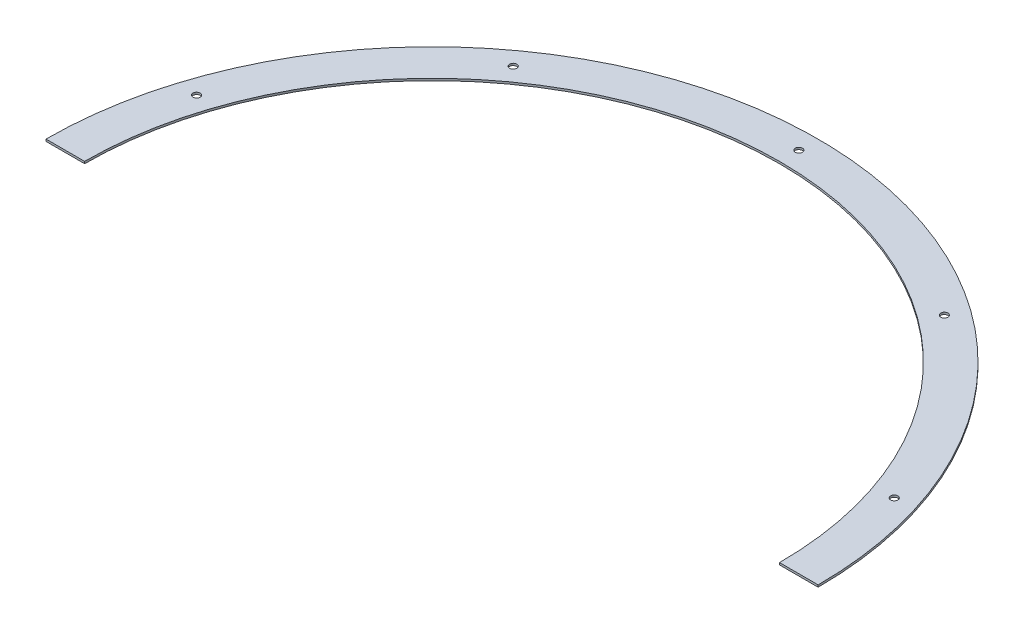
ISO-10303-21;
HEADER;
FILE_DESCRIPTION(('STEP AP214'),'2;1');
FILE_NAME('part.step','',(''),(''),'','','');
FILE_SCHEMA(('AUTOMOTIVE_DESIGN { 1 0 10303 214 1 1 1 1 }'));
ENDSEC;
DATA;
#1=APPLICATION_CONTEXT('core data for automotive mechanical design processes');
#2=APPLICATION_PROTOCOL_DEFINITION('international standard','automotive_design',2000,#1);
#3=PRODUCT_CONTEXT('',#1,'mechanical');
#4=PRODUCT('Part','Part','',(#3));
#5=PRODUCT_RELATED_PRODUCT_CATEGORY('part','',(#4));
#6=PRODUCT_DEFINITION_FORMATION('','',#4);
#7=PRODUCT_DEFINITION_CONTEXT('part definition',#1,'design');
#8=PRODUCT_DEFINITION('design','',#6,#7);
#9=PRODUCT_DEFINITION_SHAPE('','',#8);
#10=(LENGTH_UNIT() NAMED_UNIT(*) SI_UNIT(.MILLI.,.METRE.));
#11=(NAMED_UNIT(*) PLANE_ANGLE_UNIT() SI_UNIT($,.RADIAN.));
#12=(NAMED_UNIT(*) SI_UNIT($,.STERADIAN.) SOLID_ANGLE_UNIT());
#13=UNCERTAINTY_MEASURE_WITH_UNIT(LENGTH_MEASURE(1.E-05),#10,'distance_accuracy_value','');
#14=(GEOMETRIC_REPRESENTATION_CONTEXT(3) GLOBAL_UNCERTAINTY_ASSIGNED_CONTEXT((#13)) GLOBAL_UNIT_ASSIGNED_CONTEXT((#10,
#11,#12)) REPRESENTATION_CONTEXT('',''));
#15=CARTESIAN_POINT('',(0.,0.,0.));
#16=DIRECTION('',(0.,0.,1.));
#17=DIRECTION('',(1.,0.,0.));
#18=AXIS2_PLACEMENT_3D('',#15,#16,#17);
#19=CARTESIAN_POINT('',(0.,0.,0.));
#20=DIRECTION('',(0.,0.,1.));
#21=DIRECTION('',(0.,1.,0.));
#22=AXIS2_PLACEMENT_3D('',#19,#20,#21);
#23=PLANE('',#22);
#24=DIRECTION('',(1.,0.,0.));
#25=VECTOR('',#24,1.);
#26=CARTESIAN_POINT('',(0.,2.032,0.));
#27=LINE('',#26,#25);
#28=CARTESIAN_POINT('',(-381.,2.032,0.));
#29=VERTEX_POINT('',#28);
#30=CARTESIAN_POINT('',(-342.9,2.032,0.));
#31=VERTEX_POINT('',#30);
#32=EDGE_CURVE('E73',#29,#31,#27,.T.);
#33=ORIENTED_EDGE('',*,*,#32,.F.);
#34=DIRECTION('',(0.,-1.,0.));
#35=VECTOR('',#34,1.);
#36=CARTESIAN_POINT('',(-381.,2.032,0.));
#37=LINE('',#36,#35);
#38=CARTESIAN_POINT('',(-381.,0.,0.));
#39=VERTEX_POINT('',#38);
#40=EDGE_CURVE('E82',#29,#39,#37,.T.);
#41=ORIENTED_EDGE('',*,*,#40,.T.);
#42=DIRECTION('',(1.,0.,0.));
#43=VECTOR('',#42,1.);
#44=CARTESIAN_POINT('',(0.,0.,0.));
#45=LINE('',#44,#43);
#46=CARTESIAN_POINT('',(-342.9,0.,0.));
#47=VERTEX_POINT('',#46);
#48=EDGE_CURVE('E83',#39,#47,#45,.T.);
#49=ORIENTED_EDGE('',*,*,#48,.T.);
#50=DIRECTION('',(0.,-1.,0.));
#51=VECTOR('',#50,1.);
#52=CARTESIAN_POINT('',(-342.9,2.032,0.));
#53=LINE('',#52,#51);
#54=EDGE_CURVE('E43',#31,#47,#53,.T.);
#55=ORIENTED_EDGE('',*,*,#54,.F.);
#56=EDGE_LOOP('',(#33,#41,#49,#55));
#57=FACE_BOUND('',#56,.T.);
#58=ADVANCED_FACE('F26',(#57),#23,.T.);
#59=CARTESIAN_POINT('',(342.9,0.,0.));
#60=VERTEX_POINT('',#59);
#61=CARTESIAN_POINT('',(381.,0.,0.));
#62=VERTEX_POINT('',#61);
#63=EDGE_CURVE('E87',#60,#62,#45,.T.);
#64=ORIENTED_EDGE('',*,*,#63,.T.);
#65=DIRECTION('',(0.,-1.,0.));
#66=VECTOR('',#65,1.);
#67=CARTESIAN_POINT('',(381.,2.032,0.));
#68=LINE('',#67,#66);
#69=CARTESIAN_POINT('',(381.,2.032,0.));
#70=VERTEX_POINT('',#69);
#71=EDGE_CURVE('E88',#62,#70,#68,.F.);
#72=ORIENTED_EDGE('',*,*,#71,.T.);
#73=CARTESIAN_POINT('',(342.9,2.032,0.));
#74=VERTEX_POINT('',#73);
#75=EDGE_CURVE('E74',#74,#70,#27,.T.);
#76=ORIENTED_EDGE('',*,*,#75,.F.);
#77=DIRECTION('',(0.,-1.,0.));
#78=VECTOR('',#77,1.);
#79=CARTESIAN_POINT('',(342.9,2.032,0.));
#80=LINE('',#79,#78);
#81=EDGE_CURVE('E51',#60,#74,#80,.F.);
#82=ORIENTED_EDGE('',*,*,#81,.F.);
#83=EDGE_LOOP('',(#64,#72,#76,#82));
#84=FACE_BOUND('',#83,.T.);
#85=ADVANCED_FACE('F130',(#84),#23,.T.);
#86=CARTESIAN_POINT('',(212.748872067257,-0.00100000000000013,-292.823701114015));
#87=DIRECTION('',(0.,1.,0.));
#88=DIRECTION('',(-1.,0.,0.));
#89=AXIS2_PLACEMENT_3D('',#86,#87,#88);
#90=CYLINDRICAL_SURFACE('',#89,3.55599999999999);
#91=CARTESIAN_POINT('',(212.748872067257,2.032,-292.823701114015));
#92=DIRECTION('',(0.,1.,0.));
#93=DIRECTION('',(-0.809016994374955,0.,-0.587785252292462));
#94=AXIS2_PLACEMENT_3D('',#91,#92,#93);
#95=CIRCLE('',#94,3.55599999999999);
#96=CARTESIAN_POINT('',(209.872007635259,2.032,-294.913865471167));
#97=VERTEX_POINT('',#96);
#98=EDGE_CURVE('E11',#97,#97,#95,.T.);
#99=ORIENTED_EDGE('',*,*,#98,.T.);
#100=EDGE_LOOP('',(#99));
#101=FACE_BOUND('',#100,.T.);
#102=CARTESIAN_POINT('',(212.748872067257,0.,-292.823701114015));
#103=DIRECTION('',(0.,1.,0.));
#104=DIRECTION('',(-1.,0.,0.));
#105=AXIS2_PLACEMENT_3D('',#102,#103,#104);
#106=CIRCLE('',#105,3.55599999999999);
#107=CARTESIAN_POINT('',(209.192872067257,0.,-292.823701114015));
#108=VERTEX_POINT('',#107);
#109=EDGE_CURVE('E35',#108,#108,#106,.F.);
#110=ORIENTED_EDGE('',*,*,#109,.T.);
#111=EDGE_LOOP('',(#110));
#112=FACE_BOUND('',#111,.T.);
#113=ADVANCED_FACE('F132',(#101,#112),#90,.F.);
#114=CARTESIAN_POINT('',(344.23490607303,-0.00100000000000013,-111.848701114016));
#115=DIRECTION('',(0.,1.,0.));
#116=DIRECTION('',(-1.,0.,0.));
#117=AXIS2_PLACEMENT_3D('',#114,#115,#116);
#118=CYLINDRICAL_SURFACE('',#117,3.55599999999999);
#119=CARTESIAN_POINT('',(344.23490607303,2.032,-111.848701114016));
#120=DIRECTION('',(0.,1.,0.));
#121=DIRECTION('',(-0.309016994374958,0.,-0.95105651629515));
#122=AXIS2_PLACEMENT_3D('',#119,#120,#121);
#123=CIRCLE('',#122,3.55599999999999);
#124=CARTESIAN_POINT('',(343.136041641032,2.032,-115.230658085962));
#125=VERTEX_POINT('',#124);
#126=EDGE_CURVE('E122',#125,#125,#123,.T.);
#127=ORIENTED_EDGE('',*,*,#126,.T.);
#128=EDGE_LOOP('',(#127));
#129=FACE_BOUND('',#128,.T.);
#130=CARTESIAN_POINT('',(344.23490607303,0.,-111.848701114016));
#131=DIRECTION('',(0.,1.,0.));
#132=DIRECTION('',(-1.,0.,0.));
#133=AXIS2_PLACEMENT_3D('',#130,#131,#132);
#134=CIRCLE('',#133,3.55599999999999);
#135=CARTESIAN_POINT('',(340.67890607303,0.,-111.848701114016));
#136=VERTEX_POINT('',#135);
#137=EDGE_CURVE('E119',#136,#136,#134,.F.);
#138=ORIENTED_EDGE('',*,*,#137,.T.);
#139=EDGE_LOOP('',(#138));
#140=FACE_BOUND('',#139,.T.);
#141=ADVANCED_FACE('F138',(#129,#140),#118,.F.);
#142=CARTESIAN_POINT('',(-344.234906073031,-0.00100000000000013,-111.848701114011));
#143=DIRECTION('',(0.,1.,0.));
#144=DIRECTION('',(-1.,0.,0.));
#145=AXIS2_PLACEMENT_3D('',#142,#143,#144);
#146=CYLINDRICAL_SURFACE('',#145,3.55599999999999);
#147=CARTESIAN_POINT('',(-344.234906073031,2.032,-111.848701114011));
#148=DIRECTION('',(0.,1.,0.));
#149=DIRECTION('',(-0.309016994374945,0.,0.951056516295155));
#150=AXIS2_PLACEMENT_3D('',#147,#148,#149);
#151=CIRCLE('',#150,3.55599999999999);
#152=CARTESIAN_POINT('',(-345.333770505028,2.032,-108.466744142066));
#153=VERTEX_POINT('',#152);
#154=EDGE_CURVE('E116',#153,#153,#151,.T.);
#155=ORIENTED_EDGE('',*,*,#154,.T.);
#156=EDGE_LOOP('',(#155));
#157=FACE_BOUND('',#156,.T.);
#158=CARTESIAN_POINT('',(-344.234906073031,0.,-111.848701114011));
#159=DIRECTION('',(0.,1.,0.));
#160=DIRECTION('',(-1.,0.,0.));
#161=AXIS2_PLACEMENT_3D('',#158,#159,#160);
#162=CIRCLE('',#161,3.55599999999999);
#163=CARTESIAN_POINT('',(-347.790906073031,0.,-111.848701114011));
#164=VERTEX_POINT('',#163);
#165=EDGE_CURVE('E113',#164,#164,#162,.F.);
#166=ORIENTED_EDGE('',*,*,#165,.T.);
#167=EDGE_LOOP('',(#166));
#168=FACE_BOUND('',#167,.T.);
#169=ADVANCED_FACE('F177',(#157,#168),#146,.F.);
#170=CARTESIAN_POINT('',(-212.748872067261,-0.00100000000000013,-292.823701114012));
#171=DIRECTION('',(0.,1.,0.));
#172=DIRECTION('',(-1.,0.,0.));
#173=AXIS2_PLACEMENT_3D('',#170,#171,#172);
#174=CYLINDRICAL_SURFACE('',#173,3.55599999999999);
#175=CARTESIAN_POINT('',(-212.748872067261,2.032,-292.823701114012));
#176=DIRECTION('',(0.,1.,0.));
#177=DIRECTION('',(-0.809016994374947,0.,0.587785252292474));
#178=AXIS2_PLACEMENT_3D('',#175,#176,#177);
#179=CIRCLE('',#178,3.55599999999999);
#180=CARTESIAN_POINT('',(-215.625736499258,2.032,-290.73353675686));
#181=VERTEX_POINT('',#180);
#182=EDGE_CURVE('E110',#181,#181,#179,.T.);
#183=ORIENTED_EDGE('',*,*,#182,.T.);
#184=EDGE_LOOP('',(#183));
#185=FACE_BOUND('',#184,.T.);
#186=CARTESIAN_POINT('',(-212.748872067261,0.,-292.823701114012));
#187=DIRECTION('',(0.,1.,0.));
#188=DIRECTION('',(-1.,0.,0.));
#189=AXIS2_PLACEMENT_3D('',#186,#187,#188);
#190=CIRCLE('',#189,3.55599999999999);
#191=CARTESIAN_POINT('',(-216.304872067261,0.,-292.823701114012));
#192=VERTEX_POINT('',#191);
#193=EDGE_CURVE('E105',#192,#192,#190,.F.);
#194=ORIENTED_EDGE('',*,*,#193,.T.);
#195=EDGE_LOOP('',(#194));
#196=FACE_BOUND('',#195,.T.);
#197=ADVANCED_FACE('F169',(#185,#196),#174,.F.);
#198=CARTESIAN_POINT('',(0.,-0.00100000000000013,-361.95));
#199=DIRECTION('',(0.,1.,0.));
#200=DIRECTION('',(-1.,0.,0.));
#201=AXIS2_PLACEMENT_3D('',#198,#199,#200);
#202=CYLINDRICAL_SURFACE('',#201,3.55599999999999);
#203=CARTESIAN_POINT('',(0.,2.032,-361.95));
#204=DIRECTION('',(0.,1.,0.));
#205=DIRECTION('',(-1.,0.,0.));
#206=AXIS2_PLACEMENT_3D('',#203,#204,#205);
#207=CIRCLE('',#206,3.55599999999999);
#208=CARTESIAN_POINT('',(-3.55600000000003,2.032,-361.95));
#209=VERTEX_POINT('',#208);
#210=EDGE_CURVE('E100',#209,#209,#207,.T.);
#211=ORIENTED_EDGE('',*,*,#210,.T.);
#212=EDGE_LOOP('',(#211));
#213=FACE_BOUND('',#212,.T.);
#214=CARTESIAN_POINT('',(0.,0.,-361.95));
#215=DIRECTION('',(0.,1.,0.));
#216=DIRECTION('',(-1.,0.,0.));
#217=AXIS2_PLACEMENT_3D('',#214,#215,#216);
#218=CIRCLE('',#217,3.55599999999999);
#219=CARTESIAN_POINT('',(-3.55600000000003,0.,-361.95));
#220=VERTEX_POINT('',#219);
#221=EDGE_CURVE('E96',#220,#220,#218,.F.);
#222=ORIENTED_EDGE('',*,*,#221,.T.);
#223=EDGE_LOOP('',(#222));
#224=FACE_BOUND('',#223,.T.);
#225=ADVANCED_FACE('F147',(#213,#224),#202,.F.);
#226=CARTESIAN_POINT('',(0.,0.,0.));
#227=DIRECTION('',(0.,1.,0.));
#228=DIRECTION('',(-1.,0.,0.));
#229=AXIS2_PLACEMENT_3D('',#226,#227,#228);
#230=PLANE('',#229);
#231=ORIENTED_EDGE('',*,*,#221,.F.);
#232=EDGE_LOOP('',(#231));
#233=FACE_BOUND('',#232,.T.);
#234=ORIENTED_EDGE('',*,*,#193,.F.);
#235=EDGE_LOOP('',(#234));
#236=FACE_BOUND('',#235,.T.);
#237=ORIENTED_EDGE('',*,*,#165,.F.);
#238=EDGE_LOOP('',(#237));
#239=FACE_BOUND('',#238,.T.);
#240=ORIENTED_EDGE('',*,*,#137,.F.);
#241=EDGE_LOOP('',(#240));
#242=FACE_BOUND('',#241,.T.);
#243=ORIENTED_EDGE('',*,*,#109,.F.);
#244=EDGE_LOOP('',(#243));
#245=FACE_BOUND('',#244,.T.);
#246=ORIENTED_EDGE('',*,*,#48,.F.);
#247=CARTESIAN_POINT('',(0.,0.,0.));
#248=DIRECTION('',(0.,1.,0.));
#249=DIRECTION('',(-1.,0.,0.));
#250=AXIS2_PLACEMENT_3D('',#247,#248,#249);
#251=CIRCLE('',#250,381.);
#252=EDGE_CURVE('E79',#62,#39,#251,.T.);
#253=ORIENTED_EDGE('',*,*,#252,.F.);
#254=ORIENTED_EDGE('',*,*,#63,.F.);
#255=CARTESIAN_POINT('',(0.,0.,0.));
#256=DIRECTION('',(0.,1.,0.));
#257=DIRECTION('',(-1.,0.,0.));
#258=AXIS2_PLACEMENT_3D('',#255,#256,#257);
#259=CIRCLE('',#258,342.9);
#260=EDGE_CURVE('E30',#60,#47,#259,.T.);
#261=ORIENTED_EDGE('',*,*,#260,.T.);
#262=EDGE_LOOP('',(#246,#253,#254,#261));
#263=FACE_BOUND('',#262,.T.);
#264=ADVANCED_FACE('F128',(#233,#236,#239,#242,#245,#263),#230,.F.);
#265=CARTESIAN_POINT('',(0.,2.032,0.));
#266=DIRECTION('',(0.,1.,0.));
#267=DIRECTION('',(-1.,0.,0.));
#268=AXIS2_PLACEMENT_3D('',#265,#266,#267);
#269=PLANE('',#268);
#270=ORIENTED_EDGE('',*,*,#210,.F.);
#271=EDGE_LOOP('',(#270));
#272=FACE_BOUND('',#271,.T.);
#273=ORIENTED_EDGE('',*,*,#182,.F.);
#274=EDGE_LOOP('',(#273));
#275=FACE_BOUND('',#274,.T.);
#276=ORIENTED_EDGE('',*,*,#154,.F.);
#277=EDGE_LOOP('',(#276));
#278=FACE_BOUND('',#277,.T.);
#279=ORIENTED_EDGE('',*,*,#126,.F.);
#280=EDGE_LOOP('',(#279));
#281=FACE_BOUND('',#280,.T.);
#282=ORIENTED_EDGE('',*,*,#98,.F.);
#283=EDGE_LOOP('',(#282));
#284=FACE_BOUND('',#283,.T.);
#285=CARTESIAN_POINT('',(0.,2.032,0.));
#286=DIRECTION('',(0.,1.,0.));
#287=DIRECTION('',(-1.,0.,0.));
#288=AXIS2_PLACEMENT_3D('',#285,#286,#287);
#289=CIRCLE('',#288,381.);
#290=EDGE_CURVE('E70',#70,#29,#289,.T.);
#291=ORIENTED_EDGE('',*,*,#290,.T.);
#292=ORIENTED_EDGE('',*,*,#32,.T.);
#293=CARTESIAN_POINT('',(0.,2.032,0.));
#294=DIRECTION('',(0.,1.,0.));
#295=DIRECTION('',(-1.,0.,0.));
#296=AXIS2_PLACEMENT_3D('',#293,#294,#295);
#297=CIRCLE('',#296,342.9);
#298=EDGE_CURVE('E94',#74,#31,#297,.T.);
#299=ORIENTED_EDGE('',*,*,#298,.F.);
#300=ORIENTED_EDGE('',*,*,#75,.T.);
#301=EDGE_LOOP('',(#291,#292,#299,#300));
#302=FACE_BOUND('',#301,.T.);
#303=ADVANCED_FACE('F71',(#272,#275,#278,#281,#284,#302),#269,.T.);
#304=CARTESIAN_POINT('',(0.,2.032,0.));
#305=DIRECTION('',(0.,-1.,0.));
#306=DIRECTION('',(1.,0.,0.));
#307=AXIS2_PLACEMENT_3D('',#304,#305,#306);
#308=CYLINDRICAL_SURFACE('',#307,342.9);
#309=ORIENTED_EDGE('',*,*,#298,.T.);
#310=ORIENTED_EDGE('',*,*,#54,.T.);
#311=ORIENTED_EDGE('',*,*,#260,.F.);
#312=ORIENTED_EDGE('',*,*,#81,.T.);
#313=EDGE_LOOP('',(#309,#310,#311,#312));
#314=FACE_BOUND('',#313,.T.);
#315=ADVANCED_FACE('F28',(#314),#308,.F.);
#316=CARTESIAN_POINT('',(0.,2.032,0.));
#317=DIRECTION('',(0.,-1.,0.));
#318=DIRECTION('',(1.,0.,0.));
#319=AXIS2_PLACEMENT_3D('',#316,#317,#318);
#320=CYLINDRICAL_SURFACE('',#319,381.);
#321=ORIENTED_EDGE('',*,*,#40,.F.);
#322=ORIENTED_EDGE('',*,*,#290,.F.);
#323=ORIENTED_EDGE('',*,*,#71,.F.);
#324=ORIENTED_EDGE('',*,*,#252,.T.);
#325=EDGE_LOOP('',(#321,#322,#323,#324));
#326=FACE_BOUND('',#325,.T.);
#327=ADVANCED_FACE('F85',(#326),#320,.T.);
#328=CLOSED_SHELL('',(#58,#85,#113,#141,#169,#197,#225,#264,#303,#315,#327));
#329=MANIFOLD_SOLID_BREP('B2',#328);
#330=ADVANCED_BREP_SHAPE_REPRESENTATION('',(#18,#329),#14);
#331=SHAPE_DEFINITION_REPRESENTATION(#9,#330);
ENDSEC;
END-ISO-10303-21;
